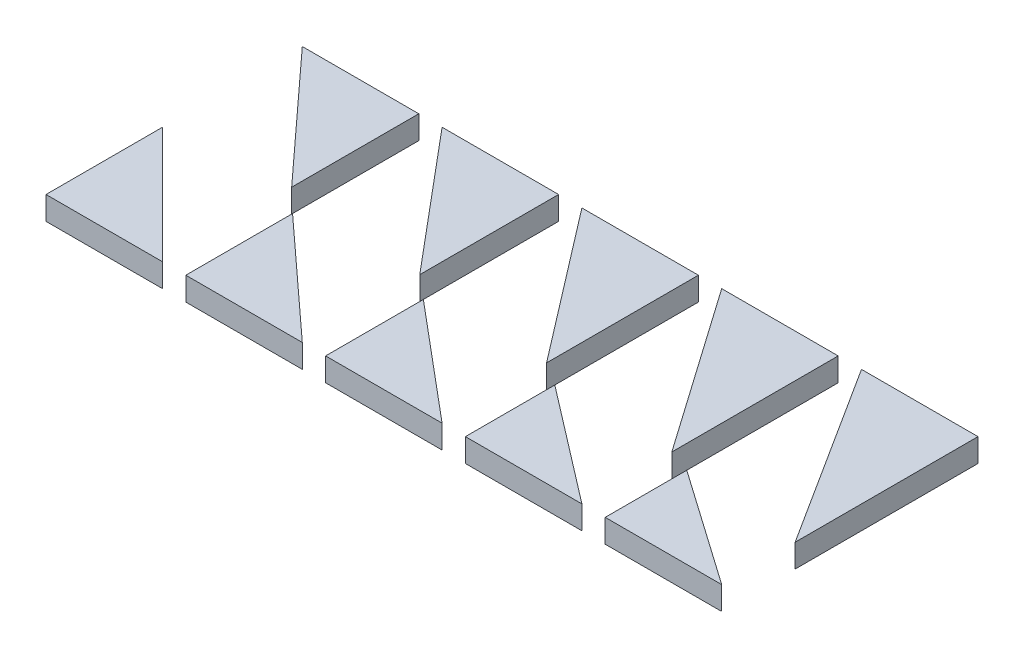
ISO-10303-21;
HEADER;
FILE_DESCRIPTION(('STEP AP214'),'2;1');
FILE_NAME('part.step','',(''),(''),'','','');
FILE_SCHEMA(('AUTOMOTIVE_DESIGN { 1 0 10303 214 1 1 1 1 }'));
ENDSEC;
DATA;
#1=APPLICATION_CONTEXT('core data for automotive mechanical design processes');
#2=APPLICATION_PROTOCOL_DEFINITION('international standard','automotive_design',2000,#1);
#3=PRODUCT_CONTEXT('',#1,'mechanical');
#4=PRODUCT('Part','Part','',(#3));
#5=PRODUCT_RELATED_PRODUCT_CATEGORY('part','',(#4));
#6=PRODUCT_DEFINITION_FORMATION('','',#4);
#7=PRODUCT_DEFINITION_CONTEXT('part definition',#1,'design');
#8=PRODUCT_DEFINITION('design','',#6,#7);
#9=PRODUCT_DEFINITION_SHAPE('','',#8);
#10=(LENGTH_UNIT() NAMED_UNIT(*) SI_UNIT(.MILLI.,.METRE.));
#11=(NAMED_UNIT(*) PLANE_ANGLE_UNIT() SI_UNIT($,.RADIAN.));
#12=(NAMED_UNIT(*) SI_UNIT($,.STERADIAN.) SOLID_ANGLE_UNIT());
#13=UNCERTAINTY_MEASURE_WITH_UNIT(LENGTH_MEASURE(1.E-05),#10,'distance_accuracy_value','');
#14=(GEOMETRIC_REPRESENTATION_CONTEXT(3) GLOBAL_UNCERTAINTY_ASSIGNED_CONTEXT((#13)) GLOBAL_UNIT_ASSIGNED_CONTEXT((#10,
#11,#12)) REPRESENTATION_CONTEXT('',''));
#15=CARTESIAN_POINT('',(0.,0.,0.));
#16=DIRECTION('',(0.,0.,1.));
#17=DIRECTION('',(1.,0.,0.));
#18=AXIS2_PLACEMENT_3D('',#15,#16,#17);
#19=CARTESIAN_POINT('',(25.0000000000003,10.,-25.));
#20=DIRECTION('',(-0.707106781186551,0.,0.707106781186544));
#21=DIRECTION('',(0.707106781186544,0.,0.707106781186551));
#22=AXIS2_PLACEMENT_3D('',#19,#20,#21);
#23=PLANE('',#22);
#24=DIRECTION('',(-0.707106781186544,0.,-0.707106781186551));
#25=VECTOR('',#24,1.);
#26=CARTESIAN_POINT('',(25.0000000000003,0.,-25.));
#27=LINE('',#26,#25);
#28=CARTESIAN_POINT('',(50.,0.,0.));
#29=VERTEX_POINT('',#28);
#30=CARTESIAN_POINT('',(0.,0.,-50.0000000000005));
#31=VERTEX_POINT('',#30);
#32=EDGE_CURVE('E109',#29,#31,#27,.T.);
#33=ORIENTED_EDGE('',*,*,#32,.T.);
#34=DIRECTION('',(0.,-1.,0.));
#35=VECTOR('',#34,1.);
#36=CARTESIAN_POINT('',(0.,10.,-50.0000000000005));
#37=LINE('',#36,#35);
#38=CARTESIAN_POINT('',(0.,10.,-50.0000000000005));
#39=VERTEX_POINT('',#38);
#40=EDGE_CURVE('E13',#39,#31,#37,.T.);
#41=ORIENTED_EDGE('',*,*,#40,.F.);
#42=DIRECTION('',(-0.707106781186544,0.,-0.707106781186551));
#43=VECTOR('',#42,1.);
#44=CARTESIAN_POINT('',(25.0000000000003,10.,-25.));
#45=LINE('',#44,#43);
#46=CARTESIAN_POINT('',(50.,10.,0.));
#47=VERTEX_POINT('',#46);
#48=EDGE_CURVE('E102',#47,#39,#45,.T.);
#49=ORIENTED_EDGE('',*,*,#48,.F.);
#50=DIRECTION('',(0.,-1.,0.));
#51=VECTOR('',#50,1.);
#52=CARTESIAN_POINT('',(50.,10.,0.));
#53=LINE('',#52,#51);
#54=EDGE_CURVE('E110',#47,#29,#53,.T.);
#55=ORIENTED_EDGE('',*,*,#54,.T.);
#56=EDGE_LOOP('',(#33,#41,#49,#55));
#57=FACE_BOUND('',#56,.T.);
#58=ADVANCED_FACE('F62',(#57),#23,.F.);
#59=CARTESIAN_POINT('',(0.,10.,0.));
#60=DIRECTION('',(1.,0.,0.));
#61=DIRECTION('',(0.,0.,-1.));
#62=AXIS2_PLACEMENT_3D('',#59,#60,#61);
#63=PLANE('',#62);
#64=DIRECTION('',(0.,0.,1.));
#65=VECTOR('',#64,1.);
#66=CARTESIAN_POINT('',(0.,0.,0.));
#67=LINE('',#66,#65);
#68=CARTESIAN_POINT('',(0.,0.,0.));
#69=VERTEX_POINT('',#68);
#70=EDGE_CURVE('E90',#31,#69,#67,.T.);
#71=ORIENTED_EDGE('',*,*,#70,.T.);
#72=DIRECTION('',(0.,-1.,0.));
#73=VECTOR('',#72,1.);
#74=CARTESIAN_POINT('',(0.,10.,0.));
#75=LINE('',#74,#73);
#76=CARTESIAN_POINT('',(0.,10.,0.));
#77=VERTEX_POINT('',#76);
#78=EDGE_CURVE('E70',#77,#69,#75,.T.);
#79=ORIENTED_EDGE('',*,*,#78,.F.);
#80=DIRECTION('',(0.,0.,1.));
#81=VECTOR('',#80,1.);
#82=CARTESIAN_POINT('',(0.,10.,0.));
#83=LINE('',#82,#81);
#84=EDGE_CURVE('E98',#39,#77,#83,.T.);
#85=ORIENTED_EDGE('',*,*,#84,.F.);
#86=ORIENTED_EDGE('',*,*,#40,.T.);
#87=EDGE_LOOP('',(#71,#79,#85,#86));
#88=FACE_BOUND('',#87,.T.);
#89=ADVANCED_FACE('F99',(#88),#63,.F.);
#90=CARTESIAN_POINT('',(0.,10.,0.));
#91=DIRECTION('',(0.,0.,-1.));
#92=DIRECTION('',(-1.,0.,0.));
#93=AXIS2_PLACEMENT_3D('',#90,#91,#92);
#94=PLANE('',#93);
#95=DIRECTION('',(1.,0.,0.));
#96=VECTOR('',#95,1.);
#97=CARTESIAN_POINT('',(0.,0.,0.));
#98=LINE('',#97,#96);
#99=EDGE_CURVE('E95',#69,#29,#98,.T.);
#100=ORIENTED_EDGE('',*,*,#99,.T.);
#101=ORIENTED_EDGE('',*,*,#54,.F.);
#102=DIRECTION('',(1.,0.,0.));
#103=VECTOR('',#102,1.);
#104=CARTESIAN_POINT('',(0.,10.,0.));
#105=LINE('',#104,#103);
#106=EDGE_CURVE('E78',#77,#47,#105,.T.);
#107=ORIENTED_EDGE('',*,*,#106,.F.);
#108=ORIENTED_EDGE('',*,*,#78,.T.);
#109=EDGE_LOOP('',(#100,#101,#107,#108));
#110=FACE_BOUND('',#109,.T.);
#111=ADVANCED_FACE('F117',(#110),#94,.F.);
#112=CARTESIAN_POINT('',(0.,10.,0.));
#113=DIRECTION('',(0.,1.,0.));
#114=DIRECTION('',(0.,0.,1.));
#115=AXIS2_PLACEMENT_3D('',#112,#113,#114);
#116=PLANE('',#115);
#117=ORIENTED_EDGE('',*,*,#48,.T.);
#118=ORIENTED_EDGE('',*,*,#84,.T.);
#119=ORIENTED_EDGE('',*,*,#106,.T.);
#120=EDGE_LOOP('',(#117,#118,#119));
#121=FACE_BOUND('',#120,.T.);
#122=ADVANCED_FACE('F105',(#121),#116,.T.);
#123=CARTESIAN_POINT('',(0.,0.,0.));
#124=DIRECTION('',(0.,1.,0.));
#125=DIRECTION('',(0.,0.,1.));
#126=AXIS2_PLACEMENT_3D('',#123,#124,#125);
#127=PLANE('',#126);
#128=ORIENTED_EDGE('',*,*,#32,.F.);
#129=ORIENTED_EDGE('',*,*,#99,.F.);
#130=ORIENTED_EDGE('',*,*,#70,.F.);
#131=EDGE_LOOP('',(#128,#129,#130));
#132=FACE_BOUND('',#131,.T.);
#133=ADVANCED_FACE('F118',(#132),#127,.F.);
#134=CLOSED_SHELL('',(#58,#89,#111,#122,#133));
#135=MANIFOLD_SOLID_BREP('B2',#134);
#136=CARTESIAN_POINT('',(50.2064341488794,10.,-54.7907083950461));
#137=DIRECTION('',(-0.675590207615664,0.,0.737277336810121));
#138=DIRECTION('',(0.737277336810121,0.,0.675590207615664));
#139=AXIS2_PLACEMENT_3D('',#136,#137,#138);
#140=PLANE('',#139);
#141=DIRECTION('',(-0.737277336810121,0.,-0.675590207615664));
#142=VECTOR('',#141,1.);
#143=CARTESIAN_POINT('',(50.2064341488794,0.,-54.7907083950461));
#144=LINE('',#143,#142);
#145=CARTESIAN_POINT('',(110.,0.,0.));
#146=VERTEX_POINT('',#145);
#147=CARTESIAN_POINT('',(60.,0.,-45.8165587008716));
#148=VERTEX_POINT('',#147);
#149=EDGE_CURVE('E217',#146,#148,#144,.T.);
#150=ORIENTED_EDGE('',*,*,#149,.T.);
#151=DIRECTION('',(0.,-1.,0.));
#152=VECTOR('',#151,1.);
#153=CARTESIAN_POINT('',(60.,10.,-45.8165587008716));
#154=LINE('',#153,#152);
#155=CARTESIAN_POINT('',(60.,10.,-45.8165587008716));
#156=VERTEX_POINT('',#155);
#157=EDGE_CURVE('E60',#156,#148,#154,.T.);
#158=ORIENTED_EDGE('',*,*,#157,.F.);
#159=DIRECTION('',(-0.737277336810121,0.,-0.675590207615664));
#160=VECTOR('',#159,1.);
#161=CARTESIAN_POINT('',(50.2064341488794,10.,-54.7907083950461));
#162=LINE('',#161,#160);
#163=CARTESIAN_POINT('',(110.,10.,0.));
#164=VERTEX_POINT('',#163);
#165=EDGE_CURVE('E210',#164,#156,#162,.T.);
#166=ORIENTED_EDGE('',*,*,#165,.F.);
#167=DIRECTION('',(0.,-1.,0.));
#168=VECTOR('',#167,1.);
#169=CARTESIAN_POINT('',(110.,10.,0.));
#170=LINE('',#169,#168);
#171=EDGE_CURVE('E218',#164,#146,#170,.T.);
#172=ORIENTED_EDGE('',*,*,#171,.T.);
#173=EDGE_LOOP('',(#150,#158,#166,#172));
#174=FACE_BOUND('',#173,.T.);
#175=ADVANCED_FACE('F170',(#174),#140,.F.);
#176=CARTESIAN_POINT('',(60.,10.,0.));
#177=DIRECTION('',(1.,0.,0.));
#178=DIRECTION('',(0.,0.,-1.));
#179=AXIS2_PLACEMENT_3D('',#176,#177,#178);
#180=PLANE('',#179);
#181=DIRECTION('',(0.,0.,1.));
#182=VECTOR('',#181,1.);
#183=CARTESIAN_POINT('',(60.,0.,0.));
#184=LINE('',#183,#182);
#185=CARTESIAN_POINT('',(60.,0.,0.));
#186=VERTEX_POINT('',#185);
#187=EDGE_CURVE('E198',#148,#186,#184,.T.);
#188=ORIENTED_EDGE('',*,*,#187,.T.);
#189=DIRECTION('',(0.,-1.,0.));
#190=VECTOR('',#189,1.);
#191=CARTESIAN_POINT('',(60.,10.,0.));
#192=LINE('',#191,#190);
#193=CARTESIAN_POINT('',(60.,10.,0.));
#194=VERTEX_POINT('',#193);
#195=EDGE_CURVE('E178',#194,#186,#192,.T.);
#196=ORIENTED_EDGE('',*,*,#195,.F.);
#197=DIRECTION('',(0.,0.,1.));
#198=VECTOR('',#197,1.);
#199=CARTESIAN_POINT('',(60.,10.,0.));
#200=LINE('',#199,#198);
#201=EDGE_CURVE('E206',#156,#194,#200,.T.);
#202=ORIENTED_EDGE('',*,*,#201,.F.);
#203=ORIENTED_EDGE('',*,*,#157,.T.);
#204=EDGE_LOOP('',(#188,#196,#202,#203));
#205=FACE_BOUND('',#204,.T.);
#206=ADVANCED_FACE('F207',(#205),#180,.F.);
#207=CARTESIAN_POINT('',(0.,10.,0.));
#208=DIRECTION('',(0.,0.,-1.));
#209=DIRECTION('',(-1.,0.,0.));
#210=AXIS2_PLACEMENT_3D('',#207,#208,#209);
#211=PLANE('',#210);
#212=DIRECTION('',(1.,0.,0.));
#213=VECTOR('',#212,1.);
#214=CARTESIAN_POINT('',(0.,0.,0.));
#215=LINE('',#214,#213);
#216=EDGE_CURVE('E203',#186,#146,#215,.T.);
#217=ORIENTED_EDGE('',*,*,#216,.T.);
#218=ORIENTED_EDGE('',*,*,#171,.F.);
#219=DIRECTION('',(1.,0.,0.));
#220=VECTOR('',#219,1.);
#221=CARTESIAN_POINT('',(0.,10.,0.));
#222=LINE('',#221,#220);
#223=EDGE_CURVE('E186',#194,#164,#222,.T.);
#224=ORIENTED_EDGE('',*,*,#223,.F.);
#225=ORIENTED_EDGE('',*,*,#195,.T.);
#226=EDGE_LOOP('',(#217,#218,#224,#225));
#227=FACE_BOUND('',#226,.T.);
#228=ADVANCED_FACE('F225',(#227),#211,.F.);
#229=CARTESIAN_POINT('',(0.,10.,0.));
#230=DIRECTION('',(0.,1.,0.));
#231=DIRECTION('',(0.,0.,1.));
#232=AXIS2_PLACEMENT_3D('',#229,#230,#231);
#233=PLANE('',#232);
#234=ORIENTED_EDGE('',*,*,#165,.T.);
#235=ORIENTED_EDGE('',*,*,#201,.T.);
#236=ORIENTED_EDGE('',*,*,#223,.T.);
#237=EDGE_LOOP('',(#234,#235,#236));
#238=FACE_BOUND('',#237,.T.);
#239=ADVANCED_FACE('F213',(#238),#233,.T.);
#240=CARTESIAN_POINT('',(0.,0.,0.));
#241=DIRECTION('',(0.,1.,0.));
#242=DIRECTION('',(0.,0.,1.));
#243=AXIS2_PLACEMENT_3D('',#240,#241,#242);
#244=PLANE('',#243);
#245=ORIENTED_EDGE('',*,*,#149,.F.);
#246=ORIENTED_EDGE('',*,*,#216,.F.);
#247=ORIENTED_EDGE('',*,*,#187,.F.);
#248=EDGE_LOOP('',(#245,#246,#247));
#249=FACE_BOUND('',#248,.T.);
#250=ADVANCED_FACE('F226',(#249),#244,.F.);
#251=CLOSED_SHELL('',(#175,#206,#228,#239,#250));
#252=MANIFOLD_SOLID_BREP('B7',#251);
#253=CARTESIAN_POINT('',(70.2399048983118,10.,-83.7086590060379));
#254=DIRECTION('',(-0.642787609686543,0.,0.766044443118974));
#255=DIRECTION('',(0.766044443118975,0.,0.642787609686544));
#256=AXIS2_PLACEMENT_3D('',#253,#254,#255);
#257=PLANE('',#256);
#258=DIRECTION('',(-0.766044443118974,0.,-0.642787609686543));
#259=VECTOR('',#258,1.);
#260=CARTESIAN_POINT('',(70.2399048983118,0.,-83.7086590060379));
#261=LINE('',#260,#259);
#262=CARTESIAN_POINT('',(170.,0.,0.));
#263=VERTEX_POINT('',#262);
#264=CARTESIAN_POINT('',(120.,0.,-41.9549815588645));
#265=VERTEX_POINT('',#264);
#266=EDGE_CURVE('E325',#263,#265,#261,.T.);
#267=ORIENTED_EDGE('',*,*,#266,.T.);
#268=DIRECTION('',(0.,-1.,0.));
#269=VECTOR('',#268,1.);
#270=CARTESIAN_POINT('',(120.,10.,-41.9549815588645));
#271=LINE('',#270,#269);
#272=CARTESIAN_POINT('',(120.,10.,-41.9549815588645));
#273=VERTEX_POINT('',#272);
#274=EDGE_CURVE('E168',#273,#265,#271,.T.);
#275=ORIENTED_EDGE('',*,*,#274,.F.);
#276=DIRECTION('',(-0.766044443118974,0.,-0.642787609686543));
#277=VECTOR('',#276,1.);
#278=CARTESIAN_POINT('',(70.2399048983118,10.,-83.7086590060379));
#279=LINE('',#278,#277);
#280=CARTESIAN_POINT('',(170.,10.,0.));
#281=VERTEX_POINT('',#280);
#282=EDGE_CURVE('E318',#281,#273,#279,.T.);
#283=ORIENTED_EDGE('',*,*,#282,.F.);
#284=DIRECTION('',(0.,-1.,0.));
#285=VECTOR('',#284,1.);
#286=CARTESIAN_POINT('',(170.,10.,0.));
#287=LINE('',#286,#285);
#288=EDGE_CURVE('E326',#281,#263,#287,.T.);
#289=ORIENTED_EDGE('',*,*,#288,.T.);
#290=EDGE_LOOP('',(#267,#275,#283,#289));
#291=FACE_BOUND('',#290,.T.);
#292=ADVANCED_FACE('F278',(#291),#257,.F.);
#293=CARTESIAN_POINT('',(120.,10.,0.));
#294=DIRECTION('',(1.,0.,0.));
#295=DIRECTION('',(0.,0.,-1.));
#296=AXIS2_PLACEMENT_3D('',#293,#294,#295);
#297=PLANE('',#296);
#298=DIRECTION('',(0.,0.,1.));
#299=VECTOR('',#298,1.);
#300=CARTESIAN_POINT('',(120.,0.,0.));
#301=LINE('',#300,#299);
#302=CARTESIAN_POINT('',(120.,0.,0.));
#303=VERTEX_POINT('',#302);
#304=EDGE_CURVE('E306',#265,#303,#301,.T.);
#305=ORIENTED_EDGE('',*,*,#304,.T.);
#306=DIRECTION('',(0.,-1.,0.));
#307=VECTOR('',#306,1.);
#308=CARTESIAN_POINT('',(120.,10.,0.));
#309=LINE('',#308,#307);
#310=CARTESIAN_POINT('',(120.,10.,0.));
#311=VERTEX_POINT('',#310);
#312=EDGE_CURVE('E286',#311,#303,#309,.T.);
#313=ORIENTED_EDGE('',*,*,#312,.F.);
#314=DIRECTION('',(0.,0.,1.));
#315=VECTOR('',#314,1.);
#316=CARTESIAN_POINT('',(120.,10.,0.));
#317=LINE('',#316,#315);
#318=EDGE_CURVE('E314',#273,#311,#317,.T.);
#319=ORIENTED_EDGE('',*,*,#318,.F.);
#320=ORIENTED_EDGE('',*,*,#274,.T.);
#321=EDGE_LOOP('',(#305,#313,#319,#320));
#322=FACE_BOUND('',#321,.T.);
#323=ADVANCED_FACE('F315',(#322),#297,.F.);
#324=CARTESIAN_POINT('',(0.,10.,0.));
#325=DIRECTION('',(0.,0.,-1.));
#326=DIRECTION('',(-1.,0.,0.));
#327=AXIS2_PLACEMENT_3D('',#324,#325,#326);
#328=PLANE('',#327);
#329=DIRECTION('',(1.,0.,0.));
#330=VECTOR('',#329,1.);
#331=CARTESIAN_POINT('',(0.,0.,0.));
#332=LINE('',#331,#330);
#333=EDGE_CURVE('E311',#303,#263,#332,.T.);
#334=ORIENTED_EDGE('',*,*,#333,.T.);
#335=ORIENTED_EDGE('',*,*,#288,.F.);
#336=DIRECTION('',(1.,0.,0.));
#337=VECTOR('',#336,1.);
#338=CARTESIAN_POINT('',(0.,10.,0.));
#339=LINE('',#338,#337);
#340=EDGE_CURVE('E294',#311,#281,#339,.T.);
#341=ORIENTED_EDGE('',*,*,#340,.F.);
#342=ORIENTED_EDGE('',*,*,#312,.T.);
#343=EDGE_LOOP('',(#334,#335,#341,#342));
#344=FACE_BOUND('',#343,.T.);
#345=ADVANCED_FACE('F333',(#344),#328,.F.);
#346=CARTESIAN_POINT('',(0.,10.,0.));
#347=DIRECTION('',(0.,1.,0.));
#348=DIRECTION('',(0.,0.,1.));
#349=AXIS2_PLACEMENT_3D('',#346,#347,#348);
#350=PLANE('',#349);
#351=ORIENTED_EDGE('',*,*,#282,.T.);
#352=ORIENTED_EDGE('',*,*,#318,.T.);
#353=ORIENTED_EDGE('',*,*,#340,.T.);
#354=EDGE_LOOP('',(#351,#352,#353));
#355=FACE_BOUND('',#354,.T.);
#356=ADVANCED_FACE('F321',(#355),#350,.T.);
#357=CARTESIAN_POINT('',(0.,0.,0.));
#358=DIRECTION('',(0.,1.,0.));
#359=DIRECTION('',(0.,0.,1.));
#360=AXIS2_PLACEMENT_3D('',#357,#358,#359);
#361=PLANE('',#360);
#362=ORIENTED_EDGE('',*,*,#266,.F.);
#363=ORIENTED_EDGE('',*,*,#333,.F.);
#364=ORIENTED_EDGE('',*,*,#304,.F.);
#365=EDGE_LOOP('',(#362,#363,#364));
#366=FACE_BOUND('',#365,.T.);
#367=ADVANCED_FACE('F334',(#366),#361,.F.);
#368=CLOSED_SHELL('',(#292,#323,#345,#356,#367));
#369=MANIFOLD_SOLID_BREP('B54',#368);
#370=CARTESIAN_POINT('',(85.2358098132112,10.,-111.081470023243));
#371=DIRECTION('',(-0.608761429008725,0.,0.793353340291232));
#372=DIRECTION('',(0.793353340291232,0.,0.608761429008725));
#373=AXIS2_PLACEMENT_3D('',#370,#371,#372);
#374=PLANE('',#373);
#375=DIRECTION('',(-0.793353340291232,0.,-0.608761429008725));
#376=VECTOR('',#375,1.);
#377=CARTESIAN_POINT('',(85.2358098132112,0.,-111.081470023243));
#378=LINE('',#377,#376);
#379=CARTESIAN_POINT('',(230.,0.,0.));
#380=VERTEX_POINT('',#379);
#381=CARTESIAN_POINT('',(180.,0.,-38.3663493989484));
#382=VERTEX_POINT('',#381);
#383=EDGE_CURVE('E433',#380,#382,#378,.T.);
#384=ORIENTED_EDGE('',*,*,#383,.T.);
#385=DIRECTION('',(0.,-1.,0.));
#386=VECTOR('',#385,1.);
#387=CARTESIAN_POINT('',(180.,10.,-38.3663493989484));
#388=LINE('',#387,#386);
#389=CARTESIAN_POINT('',(180.,10.,-38.3663493989484));
#390=VERTEX_POINT('',#389);
#391=EDGE_CURVE('E276',#390,#382,#388,.T.);
#392=ORIENTED_EDGE('',*,*,#391,.F.);
#393=DIRECTION('',(-0.793353340291232,0.,-0.608761429008725));
#394=VECTOR('',#393,1.);
#395=CARTESIAN_POINT('',(85.2358098132112,10.,-111.081470023243));
#396=LINE('',#395,#394);
#397=CARTESIAN_POINT('',(230.,10.,0.));
#398=VERTEX_POINT('',#397);
#399=EDGE_CURVE('E426',#398,#390,#396,.T.);
#400=ORIENTED_EDGE('',*,*,#399,.F.);
#401=DIRECTION('',(0.,-1.,0.));
#402=VECTOR('',#401,1.);
#403=CARTESIAN_POINT('',(230.,10.,0.));
#404=LINE('',#403,#402);
#405=EDGE_CURVE('E434',#398,#380,#404,.T.);
#406=ORIENTED_EDGE('',*,*,#405,.T.);
#407=EDGE_LOOP('',(#384,#392,#400,#406));
#408=FACE_BOUND('',#407,.T.);
#409=ADVANCED_FACE('F386',(#408),#374,.F.);
#410=CARTESIAN_POINT('',(180.,10.,0.));
#411=DIRECTION('',(1.,0.,0.));
#412=DIRECTION('',(0.,0.,-1.));
#413=AXIS2_PLACEMENT_3D('',#410,#411,#412);
#414=PLANE('',#413);
#415=DIRECTION('',(0.,0.,1.));
#416=VECTOR('',#415,1.);
#417=CARTESIAN_POINT('',(180.,0.,0.));
#418=LINE('',#417,#416);
#419=CARTESIAN_POINT('',(180.,0.,0.));
#420=VERTEX_POINT('',#419);
#421=EDGE_CURVE('E414',#382,#420,#418,.T.);
#422=ORIENTED_EDGE('',*,*,#421,.T.);
#423=DIRECTION('',(0.,-1.,0.));
#424=VECTOR('',#423,1.);
#425=CARTESIAN_POINT('',(180.,10.,0.));
#426=LINE('',#425,#424);
#427=CARTESIAN_POINT('',(180.,10.,0.));
#428=VERTEX_POINT('',#427);
#429=EDGE_CURVE('E394',#428,#420,#426,.T.);
#430=ORIENTED_EDGE('',*,*,#429,.F.);
#431=DIRECTION('',(0.,0.,1.));
#432=VECTOR('',#431,1.);
#433=CARTESIAN_POINT('',(180.,10.,0.));
#434=LINE('',#433,#432);
#435=EDGE_CURVE('E422',#390,#428,#434,.T.);
#436=ORIENTED_EDGE('',*,*,#435,.F.);
#437=ORIENTED_EDGE('',*,*,#391,.T.);
#438=EDGE_LOOP('',(#422,#430,#436,#437));
#439=FACE_BOUND('',#438,.T.);
#440=ADVANCED_FACE('F423',(#439),#414,.F.);
#441=CARTESIAN_POINT('',(0.,10.,0.));
#442=DIRECTION('',(0.,0.,-1.));
#443=DIRECTION('',(-1.,0.,0.));
#444=AXIS2_PLACEMENT_3D('',#441,#442,#443);
#445=PLANE('',#444);
#446=DIRECTION('',(1.,0.,0.));
#447=VECTOR('',#446,1.);
#448=CARTESIAN_POINT('',(0.,0.,0.));
#449=LINE('',#448,#447);
#450=EDGE_CURVE('E419',#420,#380,#449,.T.);
#451=ORIENTED_EDGE('',*,*,#450,.T.);
#452=ORIENTED_EDGE('',*,*,#405,.F.);
#453=DIRECTION('',(1.,0.,0.));
#454=VECTOR('',#453,1.);
#455=CARTESIAN_POINT('',(0.,10.,0.));
#456=LINE('',#455,#454);
#457=EDGE_CURVE('E402',#428,#398,#456,.T.);
#458=ORIENTED_EDGE('',*,*,#457,.F.);
#459=ORIENTED_EDGE('',*,*,#429,.T.);
#460=EDGE_LOOP('',(#451,#452,#458,#459));
#461=FACE_BOUND('',#460,.T.);
#462=ADVANCED_FACE('F441',(#461),#445,.F.);
#463=CARTESIAN_POINT('',(0.,10.,0.));
#464=DIRECTION('',(0.,1.,0.));
#465=DIRECTION('',(0.,0.,1.));
#466=AXIS2_PLACEMENT_3D('',#463,#464,#465);
#467=PLANE('',#466);
#468=ORIENTED_EDGE('',*,*,#399,.T.);
#469=ORIENTED_EDGE('',*,*,#435,.T.);
#470=ORIENTED_EDGE('',*,*,#457,.T.);
#471=EDGE_LOOP('',(#468,#469,#470));
#472=FACE_BOUND('',#471,.T.);
#473=ADVANCED_FACE('F429',(#472),#467,.T.);
#474=CARTESIAN_POINT('',(0.,0.,0.));
#475=DIRECTION('',(0.,1.,0.));
#476=DIRECTION('',(0.,0.,1.));
#477=AXIS2_PLACEMENT_3D('',#474,#475,#476);
#478=PLANE('',#477);
#479=ORIENTED_EDGE('',*,*,#383,.F.);
#480=ORIENTED_EDGE('',*,*,#450,.F.);
#481=ORIENTED_EDGE('',*,*,#421,.F.);
#482=EDGE_LOOP('',(#479,#480,#481));
#483=FACE_BOUND('',#482,.T.);
#484=ADVANCED_FACE('F442',(#483),#478,.F.);
#485=CLOSED_SHELL('',(#409,#440,#462,#473,#484));
#486=MANIFOLD_SOLID_BREP('B162',#485);
#487=CARTESIAN_POINT('',(95.4070792177794,10.,-136.255430013957));
#488=DIRECTION('',(-0.57357643635105,0.,0.819152044288989));
#489=DIRECTION('',(0.819152044288989,0.,0.57357643635105));
#490=AXIS2_PLACEMENT_3D('',#487,#488,#489);
#491=PLANE('',#490);
#492=DIRECTION('',(-0.819152044288989,0.,-0.57357643635105));
#493=VECTOR('',#492,1.);
#494=CARTESIAN_POINT('',(95.4070792177794,0.,-136.255430013957));
#495=LINE('',#494,#493);
#496=CARTESIAN_POINT('',(290.,0.,0.));
#497=VERTEX_POINT('',#496);
#498=CARTESIAN_POINT('',(240.,0.,-35.0103769104858));
#499=VERTEX_POINT('',#498);
#500=EDGE_CURVE('E541',#497,#499,#495,.T.);
#501=ORIENTED_EDGE('',*,*,#500,.T.);
#502=DIRECTION('',(0.,-1.,0.));
#503=VECTOR('',#502,1.);
#504=CARTESIAN_POINT('',(240.,10.,-35.0103769104858));
#505=LINE('',#504,#503);
#506=CARTESIAN_POINT('',(240.,10.,-35.0103769104858));
#507=VERTEX_POINT('',#506);
#508=EDGE_CURVE('E384',#507,#499,#505,.T.);
#509=ORIENTED_EDGE('',*,*,#508,.F.);
#510=DIRECTION('',(-0.819152044288989,0.,-0.57357643635105));
#511=VECTOR('',#510,1.);
#512=CARTESIAN_POINT('',(95.4070792177794,10.,-136.255430013957));
#513=LINE('',#512,#511);
#514=CARTESIAN_POINT('',(290.,10.,0.));
#515=VERTEX_POINT('',#514);
#516=EDGE_CURVE('E534',#515,#507,#513,.T.);
#517=ORIENTED_EDGE('',*,*,#516,.F.);
#518=DIRECTION('',(0.,-1.,0.));
#519=VECTOR('',#518,1.);
#520=CARTESIAN_POINT('',(290.,10.,0.));
#521=LINE('',#520,#519);
#522=EDGE_CURVE('E542',#515,#497,#521,.T.);
#523=ORIENTED_EDGE('',*,*,#522,.T.);
#524=EDGE_LOOP('',(#501,#509,#517,#523));
#525=FACE_BOUND('',#524,.T.);
#526=ADVANCED_FACE('F494',(#525),#491,.F.);
#527=CARTESIAN_POINT('',(240.,10.,0.));
#528=DIRECTION('',(1.,0.,0.));
#529=DIRECTION('',(0.,0.,-1.));
#530=AXIS2_PLACEMENT_3D('',#527,#528,#529);
#531=PLANE('',#530);
#532=DIRECTION('',(0.,0.,1.));
#533=VECTOR('',#532,1.);
#534=CARTESIAN_POINT('',(240.,0.,0.));
#535=LINE('',#534,#533);
#536=CARTESIAN_POINT('',(240.,0.,0.));
#537=VERTEX_POINT('',#536);
#538=EDGE_CURVE('E522',#499,#537,#535,.T.);
#539=ORIENTED_EDGE('',*,*,#538,.T.);
#540=DIRECTION('',(0.,-1.,0.));
#541=VECTOR('',#540,1.);
#542=CARTESIAN_POINT('',(240.,10.,0.));
#543=LINE('',#542,#541);
#544=CARTESIAN_POINT('',(240.,10.,0.));
#545=VERTEX_POINT('',#544);
#546=EDGE_CURVE('E502',#545,#537,#543,.T.);
#547=ORIENTED_EDGE('',*,*,#546,.F.);
#548=DIRECTION('',(0.,0.,1.));
#549=VECTOR('',#548,1.);
#550=CARTESIAN_POINT('',(240.,10.,0.));
#551=LINE('',#550,#549);
#552=EDGE_CURVE('E530',#507,#545,#551,.T.);
#553=ORIENTED_EDGE('',*,*,#552,.F.);
#554=ORIENTED_EDGE('',*,*,#508,.T.);
#555=EDGE_LOOP('',(#539,#547,#553,#554));
#556=FACE_BOUND('',#555,.T.);
#557=ADVANCED_FACE('F531',(#556),#531,.F.);
#558=CARTESIAN_POINT('',(0.,10.,0.));
#559=DIRECTION('',(0.,0.,-1.));
#560=DIRECTION('',(-1.,0.,0.));
#561=AXIS2_PLACEMENT_3D('',#558,#559,#560);
#562=PLANE('',#561);
#563=DIRECTION('',(1.,0.,0.));
#564=VECTOR('',#563,1.);
#565=CARTESIAN_POINT('',(0.,0.,0.));
#566=LINE('',#565,#564);
#567=EDGE_CURVE('E527',#537,#497,#566,.T.);
#568=ORIENTED_EDGE('',*,*,#567,.T.);
#569=ORIENTED_EDGE('',*,*,#522,.F.);
#570=DIRECTION('',(1.,0.,0.));
#571=VECTOR('',#570,1.);
#572=CARTESIAN_POINT('',(0.,10.,0.));
#573=LINE('',#572,#571);
#574=EDGE_CURVE('E510',#545,#515,#573,.T.);
#575=ORIENTED_EDGE('',*,*,#574,.F.);
#576=ORIENTED_EDGE('',*,*,#546,.T.);
#577=EDGE_LOOP('',(#568,#569,#575,#576));
#578=FACE_BOUND('',#577,.T.);
#579=ADVANCED_FACE('F549',(#578),#562,.F.);
#580=CARTESIAN_POINT('',(0.,10.,0.));
#581=DIRECTION('',(0.,1.,0.));
#582=DIRECTION('',(0.,0.,1.));
#583=AXIS2_PLACEMENT_3D('',#580,#581,#582);
#584=PLANE('',#583);
#585=ORIENTED_EDGE('',*,*,#516,.T.);
#586=ORIENTED_EDGE('',*,*,#552,.T.);
#587=ORIENTED_EDGE('',*,*,#574,.T.);
#588=EDGE_LOOP('',(#585,#586,#587));
#589=FACE_BOUND('',#588,.T.);
#590=ADVANCED_FACE('F537',(#589),#584,.T.);
#591=CARTESIAN_POINT('',(0.,0.,0.));
#592=DIRECTION('',(0.,1.,0.));
#593=DIRECTION('',(0.,0.,1.));
#594=AXIS2_PLACEMENT_3D('',#591,#592,#593);
#595=PLANE('',#594);
#596=ORIENTED_EDGE('',*,*,#500,.F.);
#597=ORIENTED_EDGE('',*,*,#567,.F.);
#598=ORIENTED_EDGE('',*,*,#538,.F.);
#599=EDGE_LOOP('',(#596,#597,#598));
#600=FACE_BOUND('',#599,.T.);
#601=ADVANCED_FACE('F550',(#600),#595,.F.);
#602=CLOSED_SHELL('',(#526,#557,#579,#590,#601));
#603=MANIFOLD_SOLID_BREP('B270',#602);
#604=CARTESIAN_POINT('',(290.,10.,0.));
#605=DIRECTION('',(-1.,0.,0.));
#606=DIRECTION('',(0.,0.,1.));
#607=AXIS2_PLACEMENT_3D('',#604,#605,#606);
#608=PLANE('',#607);
#609=DIRECTION('',(0.,0.,-1.));
#610=VECTOR('',#609,1.);
#611=CARTESIAN_POINT('',(290.,0.,0.));
#612=LINE('',#611,#610);
#613=CARTESIAN_POINT('',(290.,0.,-31.5157211441245));
#614=VERTEX_POINT('',#613);
#615=CARTESIAN_POINT('',(290.,0.,-110.));
#616=VERTEX_POINT('',#615);
#617=EDGE_CURVE('E649',#614,#616,#612,.T.);
#618=ORIENTED_EDGE('',*,*,#617,.T.);
#619=DIRECTION('',(0.,-1.,0.));
#620=VECTOR('',#619,1.);
#621=CARTESIAN_POINT('',(290.,10.,-110.));
#622=LINE('',#621,#620);
#623=CARTESIAN_POINT('',(290.,10.,-110.));
#624=VERTEX_POINT('',#623);
#625=EDGE_CURVE('E492',#624,#616,#622,.T.);
#626=ORIENTED_EDGE('',*,*,#625,.F.);
#627=DIRECTION('',(0.,0.,-1.));
#628=VECTOR('',#627,1.);
#629=CARTESIAN_POINT('',(290.,10.,0.));
#630=LINE('',#629,#628);
#631=CARTESIAN_POINT('',(290.,10.,-31.5157211441245));
#632=VERTEX_POINT('',#631);
#633=EDGE_CURVE('E642',#632,#624,#630,.T.);
#634=ORIENTED_EDGE('',*,*,#633,.F.);
#635=DIRECTION('',(0.,-1.,0.));
#636=VECTOR('',#635,1.);
#637=CARTESIAN_POINT('',(290.,10.,-31.5157211441245));
#638=LINE('',#637,#636);
#639=EDGE_CURVE('E650',#632,#614,#638,.T.);
#640=ORIENTED_EDGE('',*,*,#639,.T.);
#641=EDGE_LOOP('',(#618,#626,#634,#640));
#642=FACE_BOUND('',#641,.T.);
#643=ADVANCED_FACE('F602',(#642),#608,.F.);
#644=CARTESIAN_POINT('',(0.,10.,-110.));
#645=DIRECTION('',(0.,0.,1.));
#646=DIRECTION('',(1.,0.,0.));
#647=AXIS2_PLACEMENT_3D('',#644,#645,#646);
#648=PLANE('',#647);
#649=DIRECTION('',(-1.,0.,0.));
#650=VECTOR('',#649,1.);
#651=CARTESIAN_POINT('',(0.,0.,-110.));
#652=LINE('',#651,#650);
#653=CARTESIAN_POINT('',(240.,0.,-110.));
#654=VERTEX_POINT('',#653);
#655=EDGE_CURVE('E630',#616,#654,#652,.T.);
#656=ORIENTED_EDGE('',*,*,#655,.T.);
#657=DIRECTION('',(0.,-1.,0.));
#658=VECTOR('',#657,1.);
#659=CARTESIAN_POINT('',(240.,10.,-110.));
#660=LINE('',#659,#658);
#661=CARTESIAN_POINT('',(240.,10.,-110.));
#662=VERTEX_POINT('',#661);
#663=EDGE_CURVE('E610',#662,#654,#660,.T.);
#664=ORIENTED_EDGE('',*,*,#663,.F.);
#665=DIRECTION('',(-1.,0.,0.));
#666=VECTOR('',#665,1.);
#667=CARTESIAN_POINT('',(0.,10.,-110.));
#668=LINE('',#667,#666);
#669=EDGE_CURVE('E638',#624,#662,#668,.T.);
#670=ORIENTED_EDGE('',*,*,#669,.F.);
#671=ORIENTED_EDGE('',*,*,#625,.T.);
#672=EDGE_LOOP('',(#656,#664,#670,#671));
#673=FACE_BOUND('',#672,.T.);
#674=ADVANCED_FACE('F639',(#673),#648,.F.);
#675=CARTESIAN_POINT('',(220.561119695901,10.,-140.512930048658));
#676=DIRECTION('',(0.843391445812889,0.,-0.537299608346819));
#677=DIRECTION('',(-0.537299608346819,0.,-0.843391445812889));
#678=AXIS2_PLACEMENT_3D('',#675,#676,#677);
#679=PLANE('',#678);
#680=DIRECTION('',(0.537299608346819,0.,0.843391445812889));
#681=VECTOR('',#680,1.);
#682=CARTESIAN_POINT('',(220.561119695901,0.,-140.512930048658));
#683=LINE('',#682,#681);
#684=EDGE_CURVE('E635',#654,#614,#683,.T.);
#685=ORIENTED_EDGE('',*,*,#684,.T.);
#686=ORIENTED_EDGE('',*,*,#639,.F.);
#687=DIRECTION('',(0.537299608346819,0.,0.843391445812889));
#688=VECTOR('',#687,1.);
#689=CARTESIAN_POINT('',(220.561119695901,10.,-140.512930048658));
#690=LINE('',#689,#688);
#691=EDGE_CURVE('E618',#662,#632,#690,.T.);
#692=ORIENTED_EDGE('',*,*,#691,.F.);
#693=ORIENTED_EDGE('',*,*,#663,.T.);
#694=EDGE_LOOP('',(#685,#686,#692,#693));
#695=FACE_BOUND('',#694,.T.);
#696=ADVANCED_FACE('F657',(#695),#679,.F.);
#697=CARTESIAN_POINT('',(0.,10.,0.));
#698=DIRECTION('',(0.,1.,0.));
#699=DIRECTION('',(0.,0.,1.));
#700=AXIS2_PLACEMENT_3D('',#697,#698,#699);
#701=PLANE('',#700);
#702=ORIENTED_EDGE('',*,*,#633,.T.);
#703=ORIENTED_EDGE('',*,*,#669,.T.);
#704=ORIENTED_EDGE('',*,*,#691,.T.);
#705=EDGE_LOOP('',(#702,#703,#704));
#706=FACE_BOUND('',#705,.T.);
#707=ADVANCED_FACE('F645',(#706),#701,.T.);
#708=CARTESIAN_POINT('',(0.,0.,0.));
#709=DIRECTION('',(0.,1.,0.));
#710=DIRECTION('',(0.,0.,1.));
#711=AXIS2_PLACEMENT_3D('',#708,#709,#710);
#712=PLANE('',#711);
#713=ORIENTED_EDGE('',*,*,#617,.F.);
#714=ORIENTED_EDGE('',*,*,#684,.F.);
#715=ORIENTED_EDGE('',*,*,#655,.F.);
#716=EDGE_LOOP('',(#713,#714,#715));
#717=FACE_BOUND('',#716,.T.);
#718=ADVANCED_FACE('F658',(#717),#712,.F.);
#719=CLOSED_SHELL('',(#643,#674,#696,#707,#718));
#720=MANIFOLD_SOLID_BREP('B378',#719);
#721=CARTESIAN_POINT('',(230.,10.,0.));
#722=DIRECTION('',(-1.,0.,0.));
#723=DIRECTION('',(0.,0.,1.));
#724=AXIS2_PLACEMENT_3D('',#721,#722,#723);
#725=PLANE('',#724);
#726=DIRECTION('',(0.,0.,-1.));
#727=VECTOR('',#726,1.);
#728=CARTESIAN_POINT('',(230.,0.,0.));
#729=LINE('',#728,#727);
#730=CARTESIAN_POINT('',(230.,0.,-38.5925996628935));
#731=VERTEX_POINT('',#730);
#732=CARTESIAN_POINT('',(230.,0.,-110.));
#733=VERTEX_POINT('',#732);
#734=EDGE_CURVE('E757',#731,#733,#729,.T.);
#735=ORIENTED_EDGE('',*,*,#734,.T.);
#736=DIRECTION('',(0.,-1.,0.));
#737=VECTOR('',#736,1.);
#738=CARTESIAN_POINT('',(230.,10.,-110.));
#739=LINE('',#738,#737);
#740=CARTESIAN_POINT('',(230.,10.,-110.));
#741=VERTEX_POINT('',#740);
#742=EDGE_CURVE('E600',#741,#733,#739,.T.);
#743=ORIENTED_EDGE('',*,*,#742,.F.);
#744=DIRECTION('',(0.,0.,-1.));
#745=VECTOR('',#744,1.);
#746=CARTESIAN_POINT('',(230.,10.,0.));
#747=LINE('',#746,#745);
#748=CARTESIAN_POINT('',(230.,10.,-38.5925996628935));
#749=VERTEX_POINT('',#748);
#750=EDGE_CURVE('E750',#749,#741,#747,.T.);
#751=ORIENTED_EDGE('',*,*,#750,.F.);
#752=DIRECTION('',(0.,-1.,0.));
#753=VECTOR('',#752,1.);
#754=CARTESIAN_POINT('',(230.,10.,-38.5925996628935));
#755=LINE('',#754,#753);
#756=EDGE_CURVE('E758',#749,#731,#755,.T.);
#757=ORIENTED_EDGE('',*,*,#756,.T.);
#758=EDGE_LOOP('',(#735,#743,#751,#757));
#759=FACE_BOUND('',#758,.T.);
#760=ADVANCED_FACE('F710',(#759),#725,.F.);
#761=CARTESIAN_POINT('',(0.,10.,-110.));
#762=DIRECTION('',(0.,0.,1.));
#763=DIRECTION('',(1.,0.,0.));
#764=AXIS2_PLACEMENT_3D('',#761,#762,#763);
#765=PLANE('',#764);
#766=DIRECTION('',(-1.,0.,0.));
#767=VECTOR('',#766,1.);
#768=CARTESIAN_POINT('',(0.,0.,-110.));
#769=LINE('',#768,#767);
#770=CARTESIAN_POINT('',(180.,0.,-110.));
#771=VERTEX_POINT('',#770);
#772=EDGE_CURVE('E738',#733,#771,#769,.T.);
#773=ORIENTED_EDGE('',*,*,#772,.T.);
#774=DIRECTION('',(0.,-1.,0.));
#775=VECTOR('',#774,1.);
#776=CARTESIAN_POINT('',(180.,10.,-110.));
#777=LINE('',#776,#775);
#778=CARTESIAN_POINT('',(180.,10.,-110.));
#779=VERTEX_POINT('',#778);
#780=EDGE_CURVE('E718',#779,#771,#777,.T.);
#781=ORIENTED_EDGE('',*,*,#780,.F.);
#782=DIRECTION('',(-1.,0.,0.));
#783=VECTOR('',#782,1.);
#784=CARTESIAN_POINT('',(0.,10.,-110.));
#785=LINE('',#784,#783);
#786=EDGE_CURVE('E746',#741,#779,#785,.T.);
#787=ORIENTED_EDGE('',*,*,#786,.F.);
#788=ORIENTED_EDGE('',*,*,#742,.T.);
#789=EDGE_LOOP('',(#773,#781,#787,#788));
#790=FACE_BOUND('',#789,.T.);
#791=ADVANCED_FACE('F747',(#790),#765,.F.);
#792=CARTESIAN_POINT('',(172.464907042536,10.,-120.761227987819));
#793=DIRECTION('',(0.819152044288995,0.,-0.573576436351042));
#794=DIRECTION('',(-0.573576436351042,0.,-0.819152044288995));
#795=AXIS2_PLACEMENT_3D('',#792,#793,#794);
#796=PLANE('',#795);
#797=DIRECTION('',(0.573576436351042,0.,0.819152044288995));
#798=VECTOR('',#797,1.);
#799=CARTESIAN_POINT('',(172.464907042536,0.,-120.761227987819));
#800=LINE('',#799,#798);
#801=EDGE_CURVE('E743',#771,#731,#800,.T.);
#802=ORIENTED_EDGE('',*,*,#801,.T.);
#803=ORIENTED_EDGE('',*,*,#756,.F.);
#804=DIRECTION('',(0.573576436351042,0.,0.819152044288995));
#805=VECTOR('',#804,1.);
#806=CARTESIAN_POINT('',(172.464907042536,10.,-120.761227987819));
#807=LINE('',#806,#805);
#808=EDGE_CURVE('E726',#779,#749,#807,.T.);
#809=ORIENTED_EDGE('',*,*,#808,.F.);
#810=ORIENTED_EDGE('',*,*,#780,.T.);
#811=EDGE_LOOP('',(#802,#803,#809,#810));
#812=FACE_BOUND('',#811,.T.);
#813=ADVANCED_FACE('F765',(#812),#796,.F.);
#814=CARTESIAN_POINT('',(0.,10.,0.));
#815=DIRECTION('',(0.,1.,0.));
#816=DIRECTION('',(0.,0.,1.));
#817=AXIS2_PLACEMENT_3D('',#814,#815,#816);
#818=PLANE('',#817);
#819=ORIENTED_EDGE('',*,*,#750,.T.);
#820=ORIENTED_EDGE('',*,*,#786,.T.);
#821=ORIENTED_EDGE('',*,*,#808,.T.);
#822=EDGE_LOOP('',(#819,#820,#821));
#823=FACE_BOUND('',#822,.T.);
#824=ADVANCED_FACE('F753',(#823),#818,.T.);
#825=CARTESIAN_POINT('',(0.,0.,0.));
#826=DIRECTION('',(0.,1.,0.));
#827=DIRECTION('',(0.,0.,1.));
#828=AXIS2_PLACEMENT_3D('',#825,#826,#827);
#829=PLANE('',#828);
#830=ORIENTED_EDGE('',*,*,#734,.F.);
#831=ORIENTED_EDGE('',*,*,#801,.F.);
#832=ORIENTED_EDGE('',*,*,#772,.F.);
#833=EDGE_LOOP('',(#830,#831,#832));
#834=FACE_BOUND('',#833,.T.);
#835=ADVANCED_FACE('F766',(#834),#829,.F.);
#836=CLOSED_SHELL('',(#760,#791,#813,#824,#835));
#837=MANIFOLD_SOLID_BREP('B486',#836);
#838=CARTESIAN_POINT('',(170.,10.,0.));
#839=DIRECTION('',(-1.,0.,0.));
#840=DIRECTION('',(0.,0.,1.));
#841=AXIS2_PLACEMENT_3D('',#838,#839,#840);
#842=PLANE('',#841);
#843=DIRECTION('',(0.,0.,-1.));
#844=VECTOR('',#843,1.);
#845=CARTESIAN_POINT('',(170.,0.,0.));
#846=LINE('',#845,#844);
#847=CARTESIAN_POINT('',(170.,0.,-44.838731357939));
#848=VERTEX_POINT('',#847);
#849=CARTESIAN_POINT('',(170.,0.,-110.));
#850=VERTEX_POINT('',#849);
#851=EDGE_CURVE('E865',#848,#850,#846,.T.);
#852=ORIENTED_EDGE('',*,*,#851,.T.);
#853=DIRECTION('',(0.,-1.,0.));
#854=VECTOR('',#853,1.);
#855=CARTESIAN_POINT('',(170.,10.,-110.));
#856=LINE('',#855,#854);
#857=CARTESIAN_POINT('',(170.,10.,-110.));
#858=VERTEX_POINT('',#857);
#859=EDGE_CURVE('E708',#858,#850,#856,.T.);
#860=ORIENTED_EDGE('',*,*,#859,.F.);
#861=DIRECTION('',(0.,0.,-1.));
#862=VECTOR('',#861,1.);
#863=CARTESIAN_POINT('',(170.,10.,0.));
#864=LINE('',#863,#862);
#865=CARTESIAN_POINT('',(170.,10.,-44.838731357939));
#866=VERTEX_POINT('',#865);
#867=EDGE_CURVE('E858',#866,#858,#864,.T.);
#868=ORIENTED_EDGE('',*,*,#867,.F.);
#869=DIRECTION('',(0.,-1.,0.));
#870=VECTOR('',#869,1.);
#871=CARTESIAN_POINT('',(170.,10.,-44.838731357939));
#872=LINE('',#871,#870);
#873=EDGE_CURVE('E866',#866,#848,#872,.T.);
#874=ORIENTED_EDGE('',*,*,#873,.T.);
#875=EDGE_LOOP('',(#852,#860,#868,#874));
#876=FACE_BOUND('',#875,.T.);
#877=ADVANCED_FACE('F818',(#876),#842,.F.);
#878=CARTESIAN_POINT('',(0.,10.,-110.));
#879=DIRECTION('',(0.,0.,1.));
#880=DIRECTION('',(1.,0.,0.));
#881=AXIS2_PLACEMENT_3D('',#878,#879,#880);
#882=PLANE('',#881);
#883=DIRECTION('',(-1.,0.,0.));
#884=VECTOR('',#883,1.);
#885=CARTESIAN_POINT('',(0.,0.,-110.));
#886=LINE('',#885,#884);
#887=CARTESIAN_POINT('',(120.,0.,-110.));
#888=VERTEX_POINT('',#887);
#889=EDGE_CURVE('E846',#850,#888,#886,.T.);
#890=ORIENTED_EDGE('',*,*,#889,.T.);
#891=DIRECTION('',(0.,-1.,0.));
#892=VECTOR('',#891,1.);
#893=CARTESIAN_POINT('',(120.,10.,-110.));
#894=LINE('',#893,#892);
#895=CARTESIAN_POINT('',(120.,10.,-110.));
#896=VERTEX_POINT('',#895);
#897=EDGE_CURVE('E826',#896,#888,#894,.T.);
#898=ORIENTED_EDGE('',*,*,#897,.F.);
#899=DIRECTION('',(-1.,0.,0.));
#900=VECTOR('',#899,1.);
#901=CARTESIAN_POINT('',(0.,10.,-110.));
#902=LINE('',#901,#900);
#903=EDGE_CURVE('E854',#858,#896,#902,.T.);
#904=ORIENTED_EDGE('',*,*,#903,.F.);
#905=ORIENTED_EDGE('',*,*,#859,.T.);
#906=EDGE_LOOP('',(#890,#898,#904,#905));
#907=FACE_BOUND('',#906,.T.);
#908=ADVANCED_FACE('F855',(#907),#882,.F.);
#909=CARTESIAN_POINT('',(128.65506315205,10.,-98.7205020967047));
#910=DIRECTION('',(0.793353340291238,0.,-0.608761429008717));
#911=DIRECTION('',(-0.608761429008717,0.,-0.793353340291238));
#912=AXIS2_PLACEMENT_3D('',#909,#910,#911);
#913=PLANE('',#912);
#914=DIRECTION('',(0.608761429008717,0.,0.793353340291238));
#915=VECTOR('',#914,1.);
#916=CARTESIAN_POINT('',(128.65506315205,0.,-98.7205020967047));
#917=LINE('',#916,#915);
#918=EDGE_CURVE('E851',#888,#848,#917,.T.);
#919=ORIENTED_EDGE('',*,*,#918,.T.);
#920=ORIENTED_EDGE('',*,*,#873,.F.);
#921=DIRECTION('',(0.608761429008717,0.,0.793353340291238));
#922=VECTOR('',#921,1.);
#923=CARTESIAN_POINT('',(128.65506315205,10.,-98.7205020967047));
#924=LINE('',#923,#922);
#925=EDGE_CURVE('E834',#896,#866,#924,.T.);
#926=ORIENTED_EDGE('',*,*,#925,.F.);
#927=ORIENTED_EDGE('',*,*,#897,.T.);
#928=EDGE_LOOP('',(#919,#920,#926,#927));
#929=FACE_BOUND('',#928,.T.);
#930=ADVANCED_FACE('F873',(#929),#913,.F.);
#931=CARTESIAN_POINT('',(0.,10.,0.));
#932=DIRECTION('',(0.,1.,0.));
#933=DIRECTION('',(0.,0.,1.));
#934=AXIS2_PLACEMENT_3D('',#931,#932,#933);
#935=PLANE('',#934);
#936=ORIENTED_EDGE('',*,*,#867,.T.);
#937=ORIENTED_EDGE('',*,*,#903,.T.);
#938=ORIENTED_EDGE('',*,*,#925,.T.);
#939=EDGE_LOOP('',(#936,#937,#938));
#940=FACE_BOUND('',#939,.T.);
#941=ADVANCED_FACE('F861',(#940),#935,.T.);
#942=CARTESIAN_POINT('',(0.,0.,0.));
#943=DIRECTION('',(0.,1.,0.));
#944=DIRECTION('',(0.,0.,1.));
#945=AXIS2_PLACEMENT_3D('',#942,#943,#944);
#946=PLANE('',#945);
#947=ORIENTED_EDGE('',*,*,#851,.F.);
#948=ORIENTED_EDGE('',*,*,#918,.F.);
#949=ORIENTED_EDGE('',*,*,#889,.F.);
#950=EDGE_LOOP('',(#947,#948,#949));
#951=FACE_BOUND('',#950,.T.);
#952=ADVANCED_FACE('F874',(#951),#946,.F.);
#953=CLOSED_SHELL('',(#877,#908,#930,#941,#952));
#954=MANIFOLD_SOLID_BREP('B594',#953);
#955=CARTESIAN_POINT('',(110.,10.,0.));
#956=DIRECTION('',(-1.,0.,0.));
#957=DIRECTION('',(0.,0.,1.));
#958=AXIS2_PLACEMENT_3D('',#955,#956,#957);
#959=PLANE('',#958);
#960=DIRECTION('',(0.,0.,-1.));
#961=VECTOR('',#960,1.);
#962=CARTESIAN_POINT('',(110.,0.,0.));
#963=LINE('',#962,#961);
#964=CARTESIAN_POINT('',(110.,0.,-50.4123203702888));
#965=VERTEX_POINT('',#964);
#966=CARTESIAN_POINT('',(110.,0.,-110.));
#967=VERTEX_POINT('',#966);
#968=EDGE_CURVE('E975',#965,#967,#963,.T.);
#969=ORIENTED_EDGE('',*,*,#968,.T.);
#970=DIRECTION('',(0.,-1.,0.));
#971=VECTOR('',#970,1.);
#972=CARTESIAN_POINT('',(110.,10.,-110.));
#973=LINE('',#972,#971);
#974=CARTESIAN_POINT('',(110.,10.,-110.));
#975=VERTEX_POINT('',#974);
#976=EDGE_CURVE('E816',#975,#967,#973,.T.);
#977=ORIENTED_EDGE('',*,*,#976,.F.);
#978=DIRECTION('',(0.,0.,-1.));
#979=VECTOR('',#978,1.);
#980=CARTESIAN_POINT('',(110.,10.,0.));
#981=LINE('',#980,#979);
#982=CARTESIAN_POINT('',(110.,10.,-50.4123203702888));
#983=VERTEX_POINT('',#982);
#984=EDGE_CURVE('E968',#983,#975,#981,.T.);
#985=ORIENTED_EDGE('',*,*,#984,.F.);
#986=DIRECTION('',(0.,-1.,0.));
#987=VECTOR('',#986,1.);
#988=CARTESIAN_POINT('',(110.,10.,-50.4123203702888));
#989=LINE('',#988,#987);
#990=EDGE_CURVE('E976',#983,#965,#989,.T.);
#991=ORIENTED_EDGE('',*,*,#990,.T.);
#992=EDGE_LOOP('',(#969,#977,#985,#991));
#993=FACE_BOUND('',#992,.T.);
#994=ADVANCED_FACE('F928',(#993),#959,.F.);
#995=CARTESIAN_POINT('',(0.,10.,-110.));
#996=DIRECTION('',(0.,0.,1.));
#997=DIRECTION('',(1.,0.,0.));
#998=AXIS2_PLACEMENT_3D('',#995,#996,#997);
#999=PLANE('',#998);
#1000=DIRECTION('',(-1.,0.,0.));
#1001=VECTOR('',#1000,1.);
#1002=CARTESIAN_POINT('',(0.,0.,-110.));
#1003=LINE('',#1002,#1001);
#1004=CARTESIAN_POINT('',(60.,0.,-110.));
#1005=VERTEX_POINT('',#1004);
#1006=EDGE_CURVE('E956',#967,#1005,#1003,.T.);
#1007=ORIENTED_EDGE('',*,*,#1006,.T.);
#1008=DIRECTION('',(0.,-1.,0.));
#1009=VECTOR('',#1008,1.);
#1010=CARTESIAN_POINT('',(60.,10.,-110.));
#1011=LINE('',#1010,#1009);
#1012=CARTESIAN_POINT('',(60.,10.,-110.));
#1013=VERTEX_POINT('',#1012);
#1014=EDGE_CURVE('E936',#1013,#1005,#1011,.T.);
#1015=ORIENTED_EDGE('',*,*,#1014,.F.);
#1016=DIRECTION('',(-1.,0.,0.));
#1017=VECTOR('',#1016,1.);
#1018=CARTESIAN_POINT('',(0.,10.,-110.));
#1019=LINE('',#1018,#1017);
#1020=EDGE_CURVE('E964',#975,#1013,#1019,.T.);
#1021=ORIENTED_EDGE('',*,*,#1020,.F.);
#1022=ORIENTED_EDGE('',*,*,#976,.T.);
#1023=EDGE_LOOP('',(#1007,#1015,#1021,#1022));
#1024=FACE_BOUND('',#1023,.T.);
#1025=ADVANCED_FACE('F965',(#1024),#999,.F.);
#1026=CARTESIAN_POINT('',(89.3738717456796,10.,-74.9935828186844));
#1027=DIRECTION('',(0.766044443118982,0.,-0.642787609686535));
#1028=DIRECTION('',(-0.642787609686535,0.,-0.766044443118982));
#1029=AXIS2_PLACEMENT_3D('',#1026,#1027,#1028);
#1030=PLANE('',#1029);
#1031=DIRECTION('',(0.642787609686535,0.,0.766044443118982));
#1032=VECTOR('',#1031,1.);
#1033=CARTESIAN_POINT('',(89.3738717456796,0.,-74.9935828186844));
#1034=LINE('',#1033,#1032);
#1035=EDGE_CURVE('E961',#1005,#965,#1034,.T.);
#1036=ORIENTED_EDGE('',*,*,#1035,.T.);
#1037=ORIENTED_EDGE('',*,*,#990,.F.);
#1038=DIRECTION('',(0.642787609686535,0.,0.766044443118982));
#1039=VECTOR('',#1038,1.);
#1040=CARTESIAN_POINT('',(89.3738717456796,10.,-74.9935828186844));
#1041=LINE('',#1040,#1039);
#1042=EDGE_CURVE('E944',#1013,#983,#1041,.T.);
#1043=ORIENTED_EDGE('',*,*,#1042,.F.);
#1044=ORIENTED_EDGE('',*,*,#1014,.T.);
#1045=EDGE_LOOP('',(#1036,#1037,#1043,#1044));
#1046=FACE_BOUND('',#1045,.T.);
#1047=ADVANCED_FACE('F983',(#1046),#1030,.F.);
#1048=CARTESIAN_POINT('',(0.,10.,0.));
#1049=DIRECTION('',(0.,1.,0.));
#1050=DIRECTION('',(0.,0.,1.));
#1051=AXIS2_PLACEMENT_3D('',#1048,#1049,#1050);
#1052=PLANE('',#1051);
#1053=ORIENTED_EDGE('',*,*,#984,.T.);
#1054=ORIENTED_EDGE('',*,*,#1020,.T.);
#1055=ORIENTED_EDGE('',*,*,#1042,.T.);
#1056=EDGE_LOOP('',(#1053,#1054,#1055));
#1057=FACE_BOUND('',#1056,.T.);
#1058=ADVANCED_FACE('F971',(#1057),#1052,.T.);
#1059=CARTESIAN_POINT('',(0.,0.,0.));
#1060=DIRECTION('',(0.,1.,0.));
#1061=DIRECTION('',(0.,0.,1.));
#1062=AXIS2_PLACEMENT_3D('',#1059,#1060,#1061);
#1063=PLANE('',#1062);
#1064=ORIENTED_EDGE('',*,*,#968,.F.);
#1065=ORIENTED_EDGE('',*,*,#1035,.F.);
#1066=ORIENTED_EDGE('',*,*,#1006,.F.);
#1067=EDGE_LOOP('',(#1064,#1065,#1066));
#1068=FACE_BOUND('',#1067,.T.);
#1069=ADVANCED_FACE('F984',(#1068),#1063,.F.);
#1070=CLOSED_SHELL('',(#994,#1025,#1047,#1058,#1069));
#1071=MANIFOLD_SOLID_BREP('B702',#1070);
#1072=CARTESIAN_POINT('',(50.,10.,0.));
#1073=DIRECTION('',(-1.,0.,0.));
#1074=DIRECTION('',(0.,0.,1.));
#1075=AXIS2_PLACEMENT_3D('',#1072,#1073,#1074);
#1076=PLANE('',#1075);
#1077=DIRECTION('',(0.,0.,-1.));
#1078=VECTOR('',#1077,1.);
#1079=CARTESIAN_POINT('',(50.,0.,0.));
#1080=LINE('',#1079,#1078);
#1081=CARTESIAN_POINT('',(50.,0.,-55.4345749465359));
#1082=VERTEX_POINT('',#1081);
#1083=CARTESIAN_POINT('',(50.,0.,-110.));
#1084=VERTEX_POINT('',#1083);
#1085=EDGE_CURVE('E1073',#1082,#1084,#1080,.T.);
#1086=ORIENTED_EDGE('',*,*,#1085,.T.);
#1087=DIRECTION('',(0.,-1.,0.));
#1088=VECTOR('',#1087,1.);
#1089=CARTESIAN_POINT('',(50.,10.,-110.));
#1090=LINE('',#1089,#1088);
#1091=CARTESIAN_POINT('',(50.,10.,-110.));
#1092=VERTEX_POINT('',#1091);
#1093=EDGE_CURVE('E926',#1092,#1084,#1090,.T.);
#1094=ORIENTED_EDGE('',*,*,#1093,.F.);
#1095=DIRECTION('',(0.,0.,-1.));
#1096=VECTOR('',#1095,1.);
#1097=CARTESIAN_POINT('',(50.,10.,0.));
#1098=LINE('',#1097,#1096);
#1099=CARTESIAN_POINT('',(50.,10.,-55.4345749465359));
#1100=VERTEX_POINT('',#1099);
#1101=EDGE_CURVE('E1066',#1100,#1092,#1098,.T.);
#1102=ORIENTED_EDGE('',*,*,#1101,.F.);
#1103=DIRECTION('',(0.,-1.,0.));
#1104=VECTOR('',#1103,1.);
#1105=CARTESIAN_POINT('',(50.,10.,-55.4345749465359));
#1106=LINE('',#1105,#1104);
#1107=EDGE_CURVE('E1074',#1100,#1082,#1106,.T.);
#1108=ORIENTED_EDGE('',*,*,#1107,.T.);
#1109=EDGE_LOOP('',(#1086,#1094,#1102,#1108));
#1110=FACE_BOUND('',#1109,.T.);
#1111=ADVANCED_FACE('F1026',(#1110),#1076,.F.);
#1112=CARTESIAN_POINT('',(0.,10.,-110.));
#1113=DIRECTION('',(0.,0.,1.));
#1114=DIRECTION('',(1.,0.,0.));
#1115=AXIS2_PLACEMENT_3D('',#1112,#1113,#1114);
#1116=PLANE('',#1115);
#1117=DIRECTION('',(-1.,0.,0.));
#1118=VECTOR('',#1117,1.);
#1119=CARTESIAN_POINT('',(0.,0.,-110.));
#1120=LINE('',#1119,#1118);
#1121=CARTESIAN_POINT('',(0.,0.,-110.));
#1122=VERTEX_POINT('',#1121);
#1123=EDGE_CURVE('E1054',#1084,#1122,#1120,.T.);
#1124=ORIENTED_EDGE('',*,*,#1123,.T.);
#1125=DIRECTION('',(0.,-1.,0.));
#1126=VECTOR('',#1125,1.);
#1127=CARTESIAN_POINT('',(0.,10.,-110.));
#1128=LINE('',#1127,#1126);
#1129=CARTESIAN_POINT('',(0.,10.,-110.));
#1130=VERTEX_POINT('',#1129);
#1131=EDGE_CURVE('E1034',#1130,#1122,#1128,.T.);
#1132=ORIENTED_EDGE('',*,*,#1131,.F.);
#1133=DIRECTION('',(-1.,0.,0.));
#1134=VECTOR('',#1133,1.);
#1135=CARTESIAN_POINT('',(0.,10.,-110.));
#1136=LINE('',#1135,#1134);
#1137=EDGE_CURVE('E1062',#1092,#1130,#1136,.T.);
#1138=ORIENTED_EDGE('',*,*,#1137,.F.);
#1139=ORIENTED_EDGE('',*,*,#1093,.T.);
#1140=EDGE_LOOP('',(#1124,#1132,#1138,#1139));
#1141=FACE_BOUND('',#1140,.T.);
#1142=ADVANCED_FACE('F1063',(#1141),#1116,.F.);
#1143=CARTESIAN_POINT('',(54.790708395046,10.,-50.2064341488782));
#1144=DIRECTION('',(0.737277336810128,0.,-0.675590207615656));
#1145=DIRECTION('',(-0.675590207615656,0.,-0.737277336810128));
#1146=AXIS2_PLACEMENT_3D('',#1143,#1144,#1145);
#1147=PLANE('',#1146);
#1148=DIRECTION('',(0.675590207615656,0.,0.737277336810128));
#1149=VECTOR('',#1148,1.);
#1150=CARTESIAN_POINT('',(54.790708395046,0.,-50.2064341488782));
#1151=LINE('',#1150,#1149);
#1152=EDGE_CURVE('E1059',#1122,#1082,#1151,.T.);
#1153=ORIENTED_EDGE('',*,*,#1152,.T.);
#1154=ORIENTED_EDGE('',*,*,#1107,.F.);
#1155=DIRECTION('',(0.675590207615656,0.,0.737277336810128));
#1156=VECTOR('',#1155,1.);
#1157=CARTESIAN_POINT('',(54.790708395046,10.,-50.2064341488782));
#1158=LINE('',#1157,#1156);
#1159=EDGE_CURVE('E1042',#1130,#1100,#1158,.T.);
#1160=ORIENTED_EDGE('',*,*,#1159,.F.);
#1161=ORIENTED_EDGE('',*,*,#1131,.T.);
#1162=EDGE_LOOP('',(#1153,#1154,#1160,#1161));
#1163=FACE_BOUND('',#1162,.T.);
#1164=ADVANCED_FACE('F1081',(#1163),#1147,.F.);
#1165=CARTESIAN_POINT('',(0.,10.,0.));
#1166=DIRECTION('',(0.,1.,0.));
#1167=DIRECTION('',(0.,0.,1.));
#1168=AXIS2_PLACEMENT_3D('',#1165,#1166,#1167);
#1169=PLANE('',#1168);
#1170=ORIENTED_EDGE('',*,*,#1101,.T.);
#1171=ORIENTED_EDGE('',*,*,#1137,.T.);
#1172=ORIENTED_EDGE('',*,*,#1159,.T.);
#1173=EDGE_LOOP('',(#1170,#1171,#1172));
#1174=FACE_BOUND('',#1173,.T.);
#1175=ADVANCED_FACE('F1069',(#1174),#1169,.T.);
#1176=CARTESIAN_POINT('',(0.,0.,0.));
#1177=DIRECTION('',(0.,1.,0.));
#1178=DIRECTION('',(0.,0.,1.));
#1179=AXIS2_PLACEMENT_3D('',#1176,#1177,#1178);
#1180=PLANE('',#1179);
#1181=ORIENTED_EDGE('',*,*,#1085,.F.);
#1182=ORIENTED_EDGE('',*,*,#1152,.F.);
#1183=ORIENTED_EDGE('',*,*,#1123,.F.);
#1184=EDGE_LOOP('',(#1181,#1182,#1183));
#1185=FACE_BOUND('',#1184,.T.);
#1186=ADVANCED_FACE('F1082',(#1185),#1180,.F.);
#1187=CLOSED_SHELL('',(#1111,#1142,#1164,#1175,#1186));
#1188=MANIFOLD_SOLID_BREP('B810',#1187);
#1189=ADVANCED_BREP_SHAPE_REPRESENTATION('',(#18,#135,#252,#369,#486,#603,#720,#837,#954,#1071,
#1188),#14);
#1190=SHAPE_DEFINITION_REPRESENTATION(#9,#1189);
ENDSEC;
END-ISO-10303-21;
